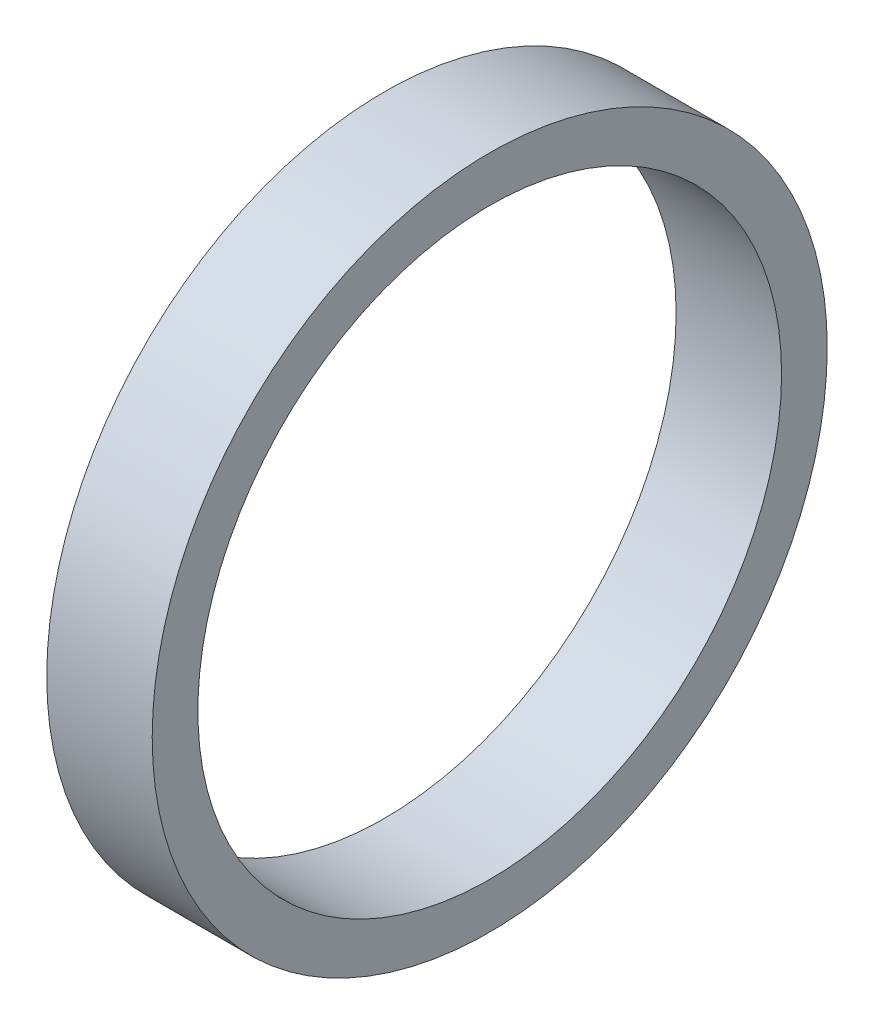
ISO-10303-21;
HEADER;
FILE_DESCRIPTION(('STEP AP214'),'2;1');
FILE_NAME('part.step','',(''),(''),'','','');
FILE_SCHEMA(('AUTOMOTIVE_DESIGN { 1 0 10303 214 1 1 1 1 }'));
ENDSEC;
DATA;
#1=APPLICATION_CONTEXT('core data for automotive mechanical design processes');
#2=APPLICATION_PROTOCOL_DEFINITION('international standard','automotive_design',2000,#1);
#3=PRODUCT_CONTEXT('',#1,'mechanical');
#4=PRODUCT('Part','Part','',(#3));
#5=PRODUCT_RELATED_PRODUCT_CATEGORY('part','',(#4));
#6=PRODUCT_DEFINITION_FORMATION('','',#4);
#7=PRODUCT_DEFINITION_CONTEXT('part definition',#1,'design');
#8=PRODUCT_DEFINITION('design','',#6,#7);
#9=PRODUCT_DEFINITION_SHAPE('','',#8);
#10=(LENGTH_UNIT() NAMED_UNIT(*) SI_UNIT(.MILLI.,.METRE.));
#11=(NAMED_UNIT(*) PLANE_ANGLE_UNIT() SI_UNIT($,.RADIAN.));
#12=(NAMED_UNIT(*) SI_UNIT($,.STERADIAN.) SOLID_ANGLE_UNIT());
#13=UNCERTAINTY_MEASURE_WITH_UNIT(LENGTH_MEASURE(1.E-05),#10,'distance_accuracy_value','');
#14=(GEOMETRIC_REPRESENTATION_CONTEXT(3) GLOBAL_UNCERTAINTY_ASSIGNED_CONTEXT((#13)) GLOBAL_UNIT_ASSIGNED_CONTEXT((#10,
#11,#12)) REPRESENTATION_CONTEXT('',''));
#15=CARTESIAN_POINT('',(0.,0.,0.));
#16=DIRECTION('',(0.,0.,1.));
#17=DIRECTION('',(1.,0.,0.));
#18=AXIS2_PLACEMENT_3D('',#15,#16,#17);
#19=CARTESIAN_POINT('',(6.35,0.,0.));
#20=DIRECTION('',(1.,0.,0.));
#21=DIRECTION('',(0.,0.,-1.));
#22=AXIS2_PLACEMENT_3D('',#19,#20,#21);
#23=PLANE('',#22);
#24=CARTESIAN_POINT('',(6.35,0.,0.));
#25=DIRECTION('',(1.,0.,0.));
#26=DIRECTION('',(0.,0.,-1.));
#27=AXIS2_PLACEMENT_3D('',#24,#25,#26);
#28=CIRCLE('',#27,20.325022);
#29=CARTESIAN_POINT('',(6.35,0.,-20.325022));
#30=VERTEX_POINT('',#29);
#31=EDGE_CURVE('E10',#30,#30,#28,.T.);
#32=ORIENTED_EDGE('',*,*,#31,.T.);
#33=EDGE_LOOP('',(#32));
#34=FACE_BOUND('',#33,.T.);
#35=CARTESIAN_POINT('',(6.35,0.,0.));
#36=DIRECTION('',(1.,0.,0.));
#37=DIRECTION('',(0.,0.,-1.));
#38=AXIS2_PLACEMENT_3D('',#35,#36,#37);
#39=CIRCLE('',#38,17.575022);
#40=CARTESIAN_POINT('',(6.35,0.,-17.575022));
#41=VERTEX_POINT('',#40);
#42=EDGE_CURVE('E42',#41,#41,#39,.T.);
#43=ORIENTED_EDGE('',*,*,#42,.F.);
#44=EDGE_LOOP('',(#43));
#45=FACE_BOUND('',#44,.T.);
#46=ADVANCED_FACE('F31',(#34,#45),#23,.T.);
#47=CARTESIAN_POINT('',(0.,0.,0.));
#48=DIRECTION('',(1.,0.,0.));
#49=DIRECTION('',(0.,0.,-1.));
#50=AXIS2_PLACEMENT_3D('',#47,#48,#49);
#51=PLANE('',#50);
#52=CARTESIAN_POINT('',(0.,0.,0.));
#53=DIRECTION('',(1.,0.,0.));
#54=DIRECTION('',(0.,0.,-1.));
#55=AXIS2_PLACEMENT_3D('',#52,#53,#54);
#56=CIRCLE('',#55,20.325022);
#57=CARTESIAN_POINT('',(0.,0.,-20.325022));
#58=VERTEX_POINT('',#57);
#59=EDGE_CURVE('E35',#58,#58,#56,.T.);
#60=ORIENTED_EDGE('',*,*,#59,.F.);
#61=EDGE_LOOP('',(#60));
#62=FACE_BOUND('',#61,.T.);
#63=CARTESIAN_POINT('',(0.,0.,0.));
#64=DIRECTION('',(1.,0.,0.));
#65=DIRECTION('',(0.,0.,-1.));
#66=AXIS2_PLACEMENT_3D('',#63,#64,#65);
#67=CIRCLE('',#66,17.575022);
#68=CARTESIAN_POINT('',(0.,0.,-17.575022));
#69=VERTEX_POINT('',#68);
#70=EDGE_CURVE('E44',#69,#69,#67,.T.);
#71=ORIENTED_EDGE('',*,*,#70,.T.);
#72=EDGE_LOOP('',(#71));
#73=FACE_BOUND('',#72,.T.);
#74=ADVANCED_FACE('F54',(#62,#73),#51,.F.);
#75=CARTESIAN_POINT('',(6.35,0.,0.));
#76=DIRECTION('',(-1.,0.,0.));
#77=DIRECTION('',(0.,0.,1.));
#78=AXIS2_PLACEMENT_3D('',#75,#76,#77);
#79=CYLINDRICAL_SURFACE('',#78,20.325022);
#80=ORIENTED_EDGE('',*,*,#31,.F.);
#81=EDGE_LOOP('',(#80));
#82=FACE_BOUND('',#81,.T.);
#83=ORIENTED_EDGE('',*,*,#59,.T.);
#84=EDGE_LOOP('',(#83));
#85=FACE_BOUND('',#84,.T.);
#86=ADVANCED_FACE('F33',(#82,#85),#79,.T.);
#87=CARTESIAN_POINT('',(6.35,0.,0.));
#88=DIRECTION('',(-1.,0.,0.));
#89=DIRECTION('',(0.,0.,1.));
#90=AXIS2_PLACEMENT_3D('',#87,#88,#89);
#91=CYLINDRICAL_SURFACE('',#90,17.575022);
#92=ORIENTED_EDGE('',*,*,#42,.T.);
#93=EDGE_LOOP('',(#92));
#94=FACE_BOUND('',#93,.T.);
#95=ORIENTED_EDGE('',*,*,#70,.F.);
#96=EDGE_LOOP('',(#95));
#97=FACE_BOUND('',#96,.T.);
#98=ADVANCED_FACE('F50',(#94,#97),#91,.F.);
#99=CLOSED_SHELL('',(#46,#74,#86,#98));
#100=MANIFOLD_SOLID_BREP('B2',#99);
#101=ADVANCED_BREP_SHAPE_REPRESENTATION('',(#18,#100),#14);
#102=SHAPE_DEFINITION_REPRESENTATION(#9,#101);
ENDSEC;
END-ISO-10303-21;
